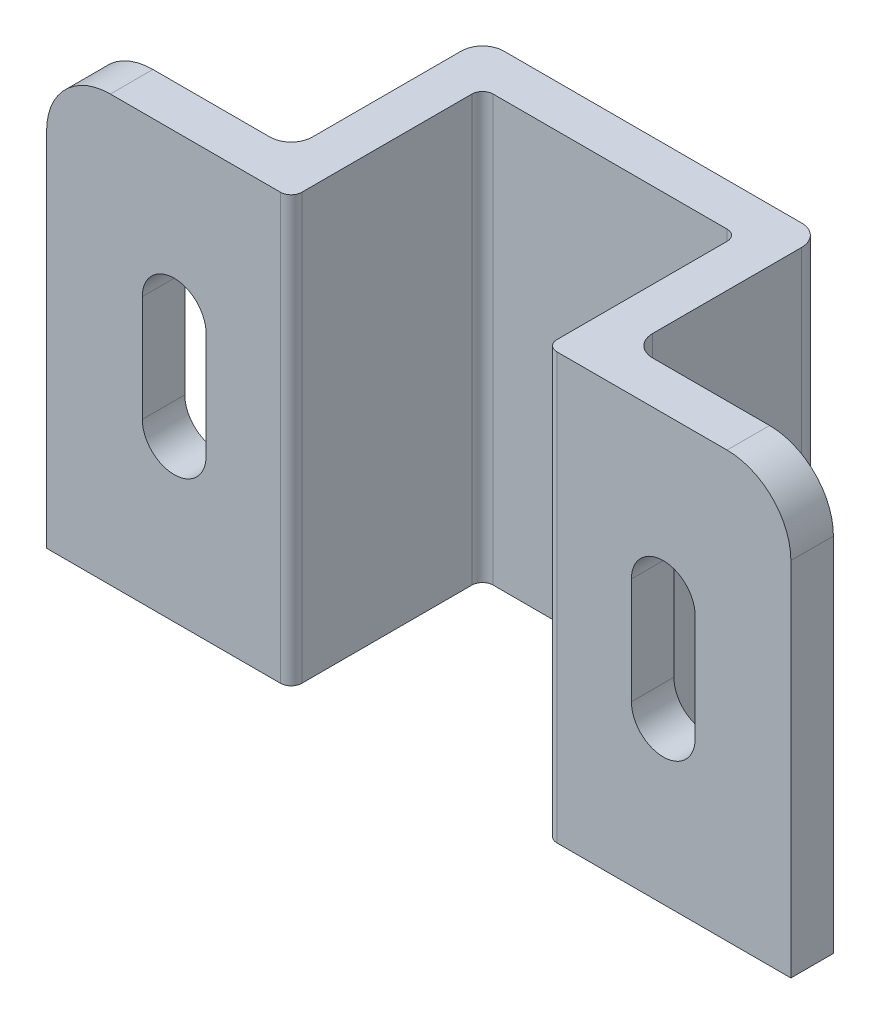
ISO-10303-21;
HEADER;
FILE_DESCRIPTION(('STEP AP214'),'2;1');
FILE_NAME('part.step','',(''),(''),'','','');
FILE_SCHEMA(('AUTOMOTIVE_DESIGN { 1 0 10303 214 1 1 1 1 }'));
ENDSEC;
DATA;
#1=APPLICATION_CONTEXT('core data for automotive mechanical design processes');
#2=APPLICATION_PROTOCOL_DEFINITION('international standard','automotive_design',2000,#1);
#3=PRODUCT_CONTEXT('',#1,'mechanical');
#4=PRODUCT('Part','Part','',(#3));
#5=PRODUCT_RELATED_PRODUCT_CATEGORY('part','',(#4));
#6=PRODUCT_DEFINITION_FORMATION('','',#4);
#7=PRODUCT_DEFINITION_CONTEXT('part definition',#1,'design');
#8=PRODUCT_DEFINITION('design','',#6,#7);
#9=PRODUCT_DEFINITION_SHAPE('','',#8);
#10=(LENGTH_UNIT() NAMED_UNIT(*) SI_UNIT(.MILLI.,.METRE.));
#11=(NAMED_UNIT(*) PLANE_ANGLE_UNIT() SI_UNIT($,.RADIAN.));
#12=(NAMED_UNIT(*) SI_UNIT($,.STERADIAN.) SOLID_ANGLE_UNIT());
#13=UNCERTAINTY_MEASURE_WITH_UNIT(LENGTH_MEASURE(1.E-05),#10,'distance_accuracy_value','');
#14=(GEOMETRIC_REPRESENTATION_CONTEXT(3) GLOBAL_UNCERTAINTY_ASSIGNED_CONTEXT((#13)) GLOBAL_UNIT_ASSIGNED_CONTEXT((#10,
#11,#12)) REPRESENTATION_CONTEXT('',''));
#15=CARTESIAN_POINT('',(0.,0.,0.));
#16=DIRECTION('',(0.,0.,1.));
#17=DIRECTION('',(1.,0.,0.));
#18=AXIS2_PLACEMENT_3D('',#15,#16,#17);
#19=CARTESIAN_POINT('',(0.,0.,2.));
#20=DIRECTION('',(0.,0.,-1.));
#21=DIRECTION('',(-1.,0.,0.));
#22=AXIS2_PLACEMENT_3D('',#19,#20,#21);
#23=PLANE('',#22);
#24=DIRECTION('',(-1.,0.,0.));
#25=VECTOR('',#24,1.);
#26=CARTESIAN_POINT('',(0.,20.,2.));
#27=LINE('',#26,#25);
#28=CARTESIAN_POINT('',(23.,20.,2.));
#29=VERTEX_POINT('',#28);
#30=CARTESIAN_POINT('',(12.,20.,2.));
#31=VERTEX_POINT('',#30);
#32=EDGE_CURVE('E341',#29,#31,#27,.T.);
#33=ORIENTED_EDGE('',*,*,#32,.T.);
#34=DIRECTION('',(0.,1.,0.));
#35=VECTOR('',#34,1.);
#36=CARTESIAN_POINT('',(12.,0.,2.));
#37=LINE('',#36,#35);
#38=CARTESIAN_POINT('',(12.,0.,2.));
#39=VERTEX_POINT('',#38);
#40=EDGE_CURVE('E399',#31,#39,#37,.F.);
#41=ORIENTED_EDGE('',*,*,#40,.T.);
#42=DIRECTION('',(1.,0.,0.));
#43=VECTOR('',#42,1.);
#44=CARTESIAN_POINT('',(0.,0.,2.));
#45=LINE('',#44,#43);
#46=CARTESIAN_POINT('',(23.,0.,2.));
#47=VERTEX_POINT('',#46);
#48=EDGE_CURVE('E338',#39,#47,#45,.T.);
#49=ORIENTED_EDGE('',*,*,#48,.T.);
#50=DIRECTION('',(0.,-1.,0.));
#51=VECTOR('',#50,1.);
#52=CARTESIAN_POINT('',(23.,20.,2.));
#53=LINE('',#52,#51);
#54=EDGE_CURVE('E397',#47,#29,#53,.F.);
#55=ORIENTED_EDGE('',*,*,#54,.T.);
#56=EDGE_LOOP('',(#33,#41,#49,#55));
#57=FACE_BOUND('',#56,.T.);
#58=ADVANCED_FACE('F33',(#57),#23,.F.);
#59=CARTESIAN_POINT('',(0.,0.,2.));
#60=DIRECTION('',(1.,0.,0.));
#61=DIRECTION('',(0.,0.,-1.));
#62=AXIS2_PLACEMENT_3D('',#59,#60,#61);
#63=PLANE('',#62);
#64=DIRECTION('',(0.,-1.,0.));
#65=VECTOR('',#64,1.);
#66=CARTESIAN_POINT('',(0.,20.,11.));
#67=LINE('',#66,#65);
#68=CARTESIAN_POINT('',(0.,17.,11.));
#69=VERTEX_POINT('',#68);
#70=CARTESIAN_POINT('',(0.,0.,11.));
#71=VERTEX_POINT('',#70);
#72=EDGE_CURVE('E323',#69,#71,#67,.T.);
#73=ORIENTED_EDGE('',*,*,#72,.F.);
#74=DIRECTION('',(0.,0.,-1.));
#75=VECTOR('',#74,1.);
#76=CARTESIAN_POINT('',(0.,17.,2.));
#77=LINE('',#76,#75);
#78=CARTESIAN_POINT('',(0.,17.,9.));
#79=VERTEX_POINT('',#78);
#80=EDGE_CURVE('E450',#69,#79,#77,.T.);
#81=ORIENTED_EDGE('',*,*,#80,.T.);
#82=DIRECTION('',(0.,1.,0.));
#83=VECTOR('',#82,1.);
#84=CARTESIAN_POINT('',(0.,0.,9.));
#85=LINE('',#84,#83);
#86=CARTESIAN_POINT('',(0.,0.,9.));
#87=VERTEX_POINT('',#86);
#88=EDGE_CURVE('E293',#87,#79,#85,.T.);
#89=ORIENTED_EDGE('',*,*,#88,.F.);
#90=DIRECTION('',(0.,0.,-1.));
#91=VECTOR('',#90,1.);
#92=CARTESIAN_POINT('',(0.,0.,2.));
#93=LINE('',#92,#91);
#94=EDGE_CURVE('E352',#71,#87,#93,.T.);
#95=ORIENTED_EDGE('',*,*,#94,.F.);
#96=EDGE_LOOP('',(#73,#81,#89,#95));
#97=FACE_BOUND('',#96,.T.);
#98=ADVANCED_FACE('F470',(#97),#63,.F.);
#99=CARTESIAN_POINT('',(0.,0.,2.));
#100=DIRECTION('',(0.,1.,0.));
#101=DIRECTION('',(0.,0.,1.));
#102=AXIS2_PLACEMENT_3D('',#99,#100,#101);
#103=PLANE('',#102);
#104=DIRECTION('',(1.,0.,0.));
#105=VECTOR('',#104,1.);
#106=CARTESIAN_POINT('',(35.,0.,11.));
#107=LINE('',#106,#105);
#108=CARTESIAN_POINT('',(24.,0.,11.));
#109=VERTEX_POINT('',#108);
#110=CARTESIAN_POINT('',(35.,0.,11.));
#111=VERTEX_POINT('',#110);
#112=EDGE_CURVE('E315',#109,#111,#107,.T.);
#113=ORIENTED_EDGE('',*,*,#112,.F.);
#114=CARTESIAN_POINT('',(24.,0.,10.5));
#115=DIRECTION('',(0.,1.,0.));
#116=DIRECTION('',(0.,0.,1.));
#117=AXIS2_PLACEMENT_3D('',#114,#115,#116);
#118=CIRCLE('',#117,0.5);
#119=CARTESIAN_POINT('',(23.5,0.,10.5));
#120=VERTEX_POINT('',#119);
#121=EDGE_CURVE('E411',#109,#120,#118,.F.);
#122=ORIENTED_EDGE('',*,*,#121,.T.);
#123=DIRECTION('',(0.,0.,-1.));
#124=VECTOR('',#123,1.);
#125=CARTESIAN_POINT('',(23.5,0.,11.));
#126=LINE('',#125,#124);
#127=CARTESIAN_POINT('',(23.5,0.,2.5));
#128=VERTEX_POINT('',#127);
#129=EDGE_CURVE('E317',#120,#128,#126,.T.);
#130=ORIENTED_EDGE('',*,*,#129,.T.);
#131=CARTESIAN_POINT('',(23.,0.,2.5));
#132=DIRECTION('',(0.,1.,0.));
#133=DIRECTION('',(0.,0.,1.));
#134=AXIS2_PLACEMENT_3D('',#131,#132,#133);
#135=CIRCLE('',#134,0.5);
#136=EDGE_CURVE('E425',#128,#47,#135,.T.);
#137=ORIENTED_EDGE('',*,*,#136,.T.);
#138=ORIENTED_EDGE('',*,*,#48,.F.);
#139=CARTESIAN_POINT('',(12.,0.,2.5));
#140=DIRECTION('',(0.,1.,0.));
#141=DIRECTION('',(0.,0.,1.));
#142=AXIS2_PLACEMENT_3D('',#139,#140,#141);
#143=CIRCLE('',#142,0.5);
#144=CARTESIAN_POINT('',(11.5,0.,2.5));
#145=VERTEX_POINT('',#144);
#146=EDGE_CURVE('E423',#39,#145,#143,.T.);
#147=ORIENTED_EDGE('',*,*,#146,.T.);
#148=DIRECTION('',(0.,0.,-1.));
#149=VECTOR('',#148,1.);
#150=CARTESIAN_POINT('',(11.5,0.,11.));
#151=LINE('',#150,#149);
#152=CARTESIAN_POINT('',(11.5,0.,10.5));
#153=VERTEX_POINT('',#152);
#154=EDGE_CURVE('E334',#153,#145,#151,.T.);
#155=ORIENTED_EDGE('',*,*,#154,.F.);
#156=CARTESIAN_POINT('',(11.,0.,10.5));
#157=DIRECTION('',(0.,1.,0.));
#158=DIRECTION('',(0.,0.,1.));
#159=AXIS2_PLACEMENT_3D('',#156,#157,#158);
#160=CIRCLE('',#159,0.5);
#161=CARTESIAN_POINT('',(11.,0.,11.));
#162=VERTEX_POINT('',#161);
#163=EDGE_CURVE('E409',#153,#162,#160,.F.);
#164=ORIENTED_EDGE('',*,*,#163,.T.);
#165=DIRECTION('',(1.,0.,0.));
#166=VECTOR('',#165,1.);
#167=CARTESIAN_POINT('',(0.,0.,11.));
#168=LINE('',#167,#166);
#169=EDGE_CURVE('E325',#71,#162,#168,.T.);
#170=ORIENTED_EDGE('',*,*,#169,.F.);
#171=ORIENTED_EDGE('',*,*,#94,.T.);
#172=DIRECTION('',(1.,0.,0.));
#173=VECTOR('',#172,1.);
#174=CARTESIAN_POINT('',(0.,0.,9.));
#175=LINE('',#174,#173);
#176=CARTESIAN_POINT('',(8.5,0.,9.));
#177=VERTEX_POINT('',#176);
#178=EDGE_CURVE('E286',#87,#177,#175,.T.);
#179=ORIENTED_EDGE('',*,*,#178,.T.);
#180=CARTESIAN_POINT('',(8.5,0.,8.));
#181=DIRECTION('',(0.,1.,0.));
#182=DIRECTION('',(0.,0.,1.));
#183=AXIS2_PLACEMENT_3D('',#180,#181,#182);
#184=CIRCLE('',#183,1.);
#185=CARTESIAN_POINT('',(9.5,0.,8.));
#186=VERTEX_POINT('',#185);
#187=EDGE_CURVE('E390',#177,#186,#184,.T.);
#188=ORIENTED_EDGE('',*,*,#187,.T.);
#189=DIRECTION('',(0.,0.,-1.));
#190=VECTOR('',#189,1.);
#191=CARTESIAN_POINT('',(9.5,0.,0.));
#192=LINE('',#191,#190);
#193=CARTESIAN_POINT('',(9.5,0.,1.));
#194=VERTEX_POINT('',#193);
#195=EDGE_CURVE('E289',#186,#194,#192,.T.);
#196=ORIENTED_EDGE('',*,*,#195,.T.);
#197=CARTESIAN_POINT('',(10.5,0.,1.));
#198=DIRECTION('',(0.,1.,0.));
#199=DIRECTION('',(0.,0.,1.));
#200=AXIS2_PLACEMENT_3D('',#197,#198,#199);
#201=CIRCLE('',#200,1.);
#202=CARTESIAN_POINT('',(10.5,0.,0.));
#203=VERTEX_POINT('',#202);
#204=EDGE_CURVE('E379',#194,#203,#201,.F.);
#205=ORIENTED_EDGE('',*,*,#204,.T.);
#206=DIRECTION('',(1.,0.,0.));
#207=VECTOR('',#206,1.);
#208=CARTESIAN_POINT('',(0.,0.,0.));
#209=LINE('',#208,#207);
#210=CARTESIAN_POINT('',(24.5,0.,0.));
#211=VERTEX_POINT('',#210);
#212=EDGE_CURVE('E337',#203,#211,#209,.T.);
#213=ORIENTED_EDGE('',*,*,#212,.T.);
#214=CARTESIAN_POINT('',(24.5,0.,1.));
#215=DIRECTION('',(0.,1.,0.));
#216=DIRECTION('',(0.,0.,1.));
#217=AXIS2_PLACEMENT_3D('',#214,#215,#216);
#218=CIRCLE('',#217,1.);
#219=CARTESIAN_POINT('',(25.5,0.,1.));
#220=VERTEX_POINT('',#219);
#221=EDGE_CURVE('E381',#211,#220,#218,.F.);
#222=ORIENTED_EDGE('',*,*,#221,.T.);
#223=DIRECTION('',(0.,0.,1.));
#224=VECTOR('',#223,1.);
#225=CARTESIAN_POINT('',(25.5,0.,0.));
#226=LINE('',#225,#224);
#227=CARTESIAN_POINT('',(25.5,0.,8.));
#228=VERTEX_POINT('',#227);
#229=EDGE_CURVE('E302',#220,#228,#226,.T.);
#230=ORIENTED_EDGE('',*,*,#229,.T.);
#231=CARTESIAN_POINT('',(26.5,0.,8.));
#232=DIRECTION('',(0.,1.,0.));
#233=DIRECTION('',(0.,0.,1.));
#234=AXIS2_PLACEMENT_3D('',#231,#232,#233);
#235=CIRCLE('',#234,1.);
#236=CARTESIAN_POINT('',(26.5,0.,9.));
#237=VERTEX_POINT('',#236);
#238=EDGE_CURVE('E385',#228,#237,#235,.T.);
#239=ORIENTED_EDGE('',*,*,#238,.T.);
#240=DIRECTION('',(1.,0.,0.));
#241=VECTOR('',#240,1.);
#242=CARTESIAN_POINT('',(35.,0.,9.));
#243=LINE('',#242,#241);
#244=CARTESIAN_POINT('',(35.,0.,9.));
#245=VERTEX_POINT('',#244);
#246=EDGE_CURVE('E305',#237,#245,#243,.T.);
#247=ORIENTED_EDGE('',*,*,#246,.T.);
#248=DIRECTION('',(0.,0.,-1.));
#249=VECTOR('',#248,1.);
#250=CARTESIAN_POINT('',(35.,0.,2.));
#251=LINE('',#250,#249);
#252=EDGE_CURVE('E345',#111,#245,#251,.T.);
#253=ORIENTED_EDGE('',*,*,#252,.F.);
#254=EDGE_LOOP('',(#113,#122,#130,#137,#138,#147,#155,#164,#170,#171,#179,#188,#196,#205,#213,
#222,#230,#239,#247,#253));
#255=FACE_BOUND('',#254,.T.);
#256=ADVANCED_FACE('F487',(#255),#103,.F.);
#257=CARTESIAN_POINT('',(35.,0.,2.));
#258=DIRECTION('',(-1.,0.,0.));
#259=DIRECTION('',(0.,0.,1.));
#260=AXIS2_PLACEMENT_3D('',#257,#258,#259);
#261=PLANE('',#260);
#262=DIRECTION('',(0.,1.,0.));
#263=VECTOR('',#262,1.);
#264=CARTESIAN_POINT('',(35.,0.,9.));
#265=LINE('',#264,#263);
#266=CARTESIAN_POINT('',(35.,17.,9.));
#267=VERTEX_POINT('',#266);
#268=EDGE_CURVE('E296',#245,#267,#265,.T.);
#269=ORIENTED_EDGE('',*,*,#268,.T.);
#270=DIRECTION('',(0.,0.,-1.));
#271=VECTOR('',#270,1.);
#272=CARTESIAN_POINT('',(35.,17.,2.));
#273=LINE('',#272,#271);
#274=CARTESIAN_POINT('',(35.,17.,11.));
#275=VERTEX_POINT('',#274);
#276=EDGE_CURVE('E41',#267,#275,#273,.F.);
#277=ORIENTED_EDGE('',*,*,#276,.T.);
#278=DIRECTION('',(0.,1.,0.));
#279=VECTOR('',#278,1.);
#280=CARTESIAN_POINT('',(35.,20.,11.));
#281=LINE('',#280,#279);
#282=EDGE_CURVE('E301',#111,#275,#281,.T.);
#283=ORIENTED_EDGE('',*,*,#282,.F.);
#284=ORIENTED_EDGE('',*,*,#252,.T.);
#285=EDGE_LOOP('',(#269,#277,#283,#284));
#286=FACE_BOUND('',#285,.T.);
#287=ADVANCED_FACE('F528',(#286),#261,.F.);
#288=CARTESIAN_POINT('',(0.,20.,2.));
#289=DIRECTION('',(0.,-1.,0.));
#290=DIRECTION('',(0.,0.,-1.));
#291=AXIS2_PLACEMENT_3D('',#288,#289,#290);
#292=PLANE('',#291);
#293=DIRECTION('',(1.,0.,0.));
#294=VECTOR('',#293,1.);
#295=CARTESIAN_POINT('',(0.,20.,9.));
#296=LINE('',#295,#294);
#297=CARTESIAN_POINT('',(3.,20.,9.));
#298=VERTEX_POINT('',#297);
#299=CARTESIAN_POINT('',(8.5,20.,9.));
#300=VERTEX_POINT('',#299);
#301=EDGE_CURVE('E294',#298,#300,#296,.T.);
#302=ORIENTED_EDGE('',*,*,#301,.F.);
#303=DIRECTION('',(0.,0.,-1.));
#304=VECTOR('',#303,1.);
#305=CARTESIAN_POINT('',(3.,20.,2.));
#306=LINE('',#305,#304);
#307=CARTESIAN_POINT('',(3.,20.,11.));
#308=VERTEX_POINT('',#307);
#309=EDGE_CURVE('E458',#298,#308,#306,.F.);
#310=ORIENTED_EDGE('',*,*,#309,.T.);
#311=DIRECTION('',(-1.,0.,0.));
#312=VECTOR('',#311,1.);
#313=CARTESIAN_POINT('',(0.,20.,11.));
#314=LINE('',#313,#312);
#315=CARTESIAN_POINT('',(11.,20.,11.));
#316=VERTEX_POINT('',#315);
#317=EDGE_CURVE('E328',#316,#308,#314,.T.);
#318=ORIENTED_EDGE('',*,*,#317,.F.);
#319=CARTESIAN_POINT('',(11.,20.,10.5));
#320=DIRECTION('',(0.,-1.,0.));
#321=DIRECTION('',(0.,0.,-1.));
#322=AXIS2_PLACEMENT_3D('',#319,#320,#321);
#323=CIRCLE('',#322,0.5);
#324=CARTESIAN_POINT('',(11.5,20.,10.5));
#325=VERTEX_POINT('',#324);
#326=EDGE_CURVE('E413',#316,#325,#323,.F.);
#327=ORIENTED_EDGE('',*,*,#326,.T.);
#328=DIRECTION('',(0.,0.,-1.));
#329=VECTOR('',#328,1.);
#330=CARTESIAN_POINT('',(11.5,20.,11.));
#331=LINE('',#330,#329);
#332=CARTESIAN_POINT('',(11.5,20.,2.5));
#333=VERTEX_POINT('',#332);
#334=EDGE_CURVE('E331',#325,#333,#331,.T.);
#335=ORIENTED_EDGE('',*,*,#334,.T.);
#336=CARTESIAN_POINT('',(12.,20.,2.5));
#337=DIRECTION('',(0.,-1.,0.));
#338=DIRECTION('',(0.,0.,-1.));
#339=AXIS2_PLACEMENT_3D('',#336,#337,#338);
#340=CIRCLE('',#339,0.5);
#341=EDGE_CURVE('E421',#333,#31,#340,.T.);
#342=ORIENTED_EDGE('',*,*,#341,.T.);
#343=ORIENTED_EDGE('',*,*,#32,.F.);
#344=CARTESIAN_POINT('',(23.,20.,2.5));
#345=DIRECTION('',(0.,-1.,0.));
#346=DIRECTION('',(0.,0.,-1.));
#347=AXIS2_PLACEMENT_3D('',#344,#345,#346);
#348=CIRCLE('',#347,0.5);
#349=CARTESIAN_POINT('',(23.5,20.,2.5));
#350=VERTEX_POINT('',#349);
#351=EDGE_CURVE('E427',#29,#350,#348,.T.);
#352=ORIENTED_EDGE('',*,*,#351,.T.);
#353=DIRECTION('',(0.,0.,-1.));
#354=VECTOR('',#353,1.);
#355=CARTESIAN_POINT('',(23.5,20.,11.));
#356=LINE('',#355,#354);
#357=CARTESIAN_POINT('',(23.5,20.,10.5));
#358=VERTEX_POINT('',#357);
#359=EDGE_CURVE('E320',#358,#350,#356,.T.);
#360=ORIENTED_EDGE('',*,*,#359,.F.);
#361=CARTESIAN_POINT('',(24.,20.,10.5));
#362=DIRECTION('',(0.,-1.,0.));
#363=DIRECTION('',(0.,0.,-1.));
#364=AXIS2_PLACEMENT_3D('',#361,#362,#363);
#365=CIRCLE('',#364,0.5);
#366=CARTESIAN_POINT('',(24.,20.,11.));
#367=VERTEX_POINT('',#366);
#368=EDGE_CURVE('E415',#358,#367,#365,.F.);
#369=ORIENTED_EDGE('',*,*,#368,.T.);
#370=DIRECTION('',(-1.,0.,0.));
#371=VECTOR('',#370,1.);
#372=CARTESIAN_POINT('',(35.,20.,11.));
#373=LINE('',#372,#371);
#374=CARTESIAN_POINT('',(32.,20.,11.));
#375=VERTEX_POINT('',#374);
#376=EDGE_CURVE('E313',#375,#367,#373,.T.);
#377=ORIENTED_EDGE('',*,*,#376,.F.);
#378=DIRECTION('',(0.,0.,-1.));
#379=VECTOR('',#378,1.);
#380=CARTESIAN_POINT('',(32.,20.,2.));
#381=LINE('',#380,#379);
#382=CARTESIAN_POINT('',(32.,20.,9.));
#383=VERTEX_POINT('',#382);
#384=EDGE_CURVE('E455',#375,#383,#381,.T.);
#385=ORIENTED_EDGE('',*,*,#384,.T.);
#386=DIRECTION('',(1.,0.,0.));
#387=VECTOR('',#386,1.);
#388=CARTESIAN_POINT('',(35.,20.,9.));
#389=LINE('',#388,#387);
#390=CARTESIAN_POINT('',(26.5,20.,9.));
#391=VERTEX_POINT('',#390);
#392=EDGE_CURVE('E306',#391,#383,#389,.T.);
#393=ORIENTED_EDGE('',*,*,#392,.F.);
#394=CARTESIAN_POINT('',(26.5,20.,8.));
#395=DIRECTION('',(0.,-1.,0.));
#396=DIRECTION('',(0.,0.,-1.));
#397=AXIS2_PLACEMENT_3D('',#394,#395,#396);
#398=CIRCLE('',#397,1.);
#399=CARTESIAN_POINT('',(25.5,20.,8.));
#400=VERTEX_POINT('',#399);
#401=EDGE_CURVE('E383',#391,#400,#398,.T.);
#402=ORIENTED_EDGE('',*,*,#401,.T.);
#403=DIRECTION('',(0.,0.,1.));
#404=VECTOR('',#403,1.);
#405=CARTESIAN_POINT('',(25.5,20.,0.));
#406=LINE('',#405,#404);
#407=CARTESIAN_POINT('',(25.5,20.,1.));
#408=VERTEX_POINT('',#407);
#409=EDGE_CURVE('E263',#408,#400,#406,.T.);
#410=ORIENTED_EDGE('',*,*,#409,.F.);
#411=CARTESIAN_POINT('',(24.5,20.,1.));
#412=DIRECTION('',(0.,-1.,0.));
#413=DIRECTION('',(0.,0.,-1.));
#414=AXIS2_PLACEMENT_3D('',#411,#412,#413);
#415=CIRCLE('',#414,1.);
#416=CARTESIAN_POINT('',(24.5,20.,0.));
#417=VERTEX_POINT('',#416);
#418=EDGE_CURVE('E372',#408,#417,#415,.F.);
#419=ORIENTED_EDGE('',*,*,#418,.T.);
#420=DIRECTION('',(-1.,0.,0.));
#421=VECTOR('',#420,1.);
#422=CARTESIAN_POINT('',(0.,20.,0.));
#423=LINE('',#422,#421);
#424=CARTESIAN_POINT('',(10.5,20.,0.));
#425=VERTEX_POINT('',#424);
#426=EDGE_CURVE('E342',#417,#425,#423,.T.);
#427=ORIENTED_EDGE('',*,*,#426,.T.);
#428=CARTESIAN_POINT('',(10.5,20.,1.));
#429=DIRECTION('',(0.,-1.,0.));
#430=DIRECTION('',(0.,0.,-1.));
#431=AXIS2_PLACEMENT_3D('',#428,#429,#430);
#432=CIRCLE('',#431,1.);
#433=CARTESIAN_POINT('',(9.5,20.,1.));
#434=VERTEX_POINT('',#433);
#435=EDGE_CURVE('E370',#425,#434,#432,.F.);
#436=ORIENTED_EDGE('',*,*,#435,.T.);
#437=DIRECTION('',(0.,0.,-1.));
#438=VECTOR('',#437,1.);
#439=CARTESIAN_POINT('',(9.5,20.,0.));
#440=LINE('',#439,#438);
#441=CARTESIAN_POINT('',(9.5,20.,8.));
#442=VERTEX_POINT('',#441);
#443=EDGE_CURVE('E290',#442,#434,#440,.T.);
#444=ORIENTED_EDGE('',*,*,#443,.F.);
#445=CARTESIAN_POINT('',(8.5,20.,8.));
#446=DIRECTION('',(0.,-1.,0.));
#447=DIRECTION('',(0.,0.,-1.));
#448=AXIS2_PLACEMENT_3D('',#445,#446,#447);
#449=CIRCLE('',#448,1.);
#450=EDGE_CURVE('E387',#442,#300,#449,.T.);
#451=ORIENTED_EDGE('',*,*,#450,.T.);
#452=EDGE_LOOP('',(#302,#310,#318,#327,#335,#342,#343,#352,#360,#369,#377,#385,#393,#402,#410,
#419,#427,#436,#444,#451));
#453=FACE_BOUND('',#452,.T.);
#454=ADVANCED_FACE('F478',(#453),#292,.F.);
#455=CARTESIAN_POINT('',(0.,0.,0.));
#456=DIRECTION('',(0.,0.,-1.));
#457=DIRECTION('',(-1.,0.,0.));
#458=AXIS2_PLACEMENT_3D('',#455,#456,#457);
#459=PLANE('',#458);
#460=ORIENTED_EDGE('',*,*,#426,.F.);
#461=DIRECTION('',(0.,1.,0.));
#462=VECTOR('',#461,1.);
#463=CARTESIAN_POINT('',(24.5,0.,0.));
#464=LINE('',#463,#462);
#465=EDGE_CURVE('E377',#417,#211,#464,.F.);
#466=ORIENTED_EDGE('',*,*,#465,.T.);
#467=ORIENTED_EDGE('',*,*,#212,.F.);
#468=DIRECTION('',(0.,1.,0.));
#469=VECTOR('',#468,1.);
#470=CARTESIAN_POINT('',(10.5,20.,0.));
#471=LINE('',#470,#469);
#472=EDGE_CURVE('E374',#203,#425,#471,.T.);
#473=ORIENTED_EDGE('',*,*,#472,.T.);
#474=EDGE_LOOP('',(#460,#466,#467,#473));
#475=FACE_BOUND('',#474,.T.);
#476=ADVANCED_FACE('F556',(#475),#459,.T.);
#477=CARTESIAN_POINT('',(11.5,20.,11.));
#478=DIRECTION('',(-1.,0.,0.));
#479=DIRECTION('',(0.,0.,1.));
#480=AXIS2_PLACEMENT_3D('',#477,#478,#479);
#481=PLANE('',#480);
#482=ORIENTED_EDGE('',*,*,#154,.T.);
#483=DIRECTION('',(0.,1.,0.));
#484=VECTOR('',#483,1.);
#485=CARTESIAN_POINT('',(11.5,20.,2.5));
#486=LINE('',#485,#484);
#487=EDGE_CURVE('E394',#145,#333,#486,.T.);
#488=ORIENTED_EDGE('',*,*,#487,.T.);
#489=ORIENTED_EDGE('',*,*,#334,.F.);
#490=DIRECTION('',(0.,1.,0.));
#491=VECTOR('',#490,1.);
#492=CARTESIAN_POINT('',(11.5,0.,10.5));
#493=LINE('',#492,#491);
#494=EDGE_CURVE('E392',#325,#153,#493,.F.);
#495=ORIENTED_EDGE('',*,*,#494,.T.);
#496=EDGE_LOOP('',(#482,#488,#489,#495));
#497=FACE_BOUND('',#496,.T.);
#498=ADVANCED_FACE('F497',(#497),#481,.F.);
#499=CARTESIAN_POINT('',(0.,0.,11.));
#500=DIRECTION('',(0.,0.,1.));
#501=DIRECTION('',(1.,0.,0.));
#502=AXIS2_PLACEMENT_3D('',#499,#500,#501);
#503=PLANE('',#502);
#504=CARTESIAN_POINT('',(6.,12.5,11.));
#505=DIRECTION('',(0.,0.,1.));
#506=DIRECTION('',(1.,0.,0.));
#507=AXIS2_PLACEMENT_3D('',#504,#505,#506);
#508=CIRCLE('',#507,1.5);
#509=CARTESIAN_POINT('',(7.5,12.5,11.));
#510=VERTEX_POINT('',#509);
#511=CARTESIAN_POINT('',(4.5,12.5,11.));
#512=VERTEX_POINT('',#511);
#513=EDGE_CURVE('E251',#510,#512,#508,.T.);
#514=ORIENTED_EDGE('',*,*,#513,.F.);
#515=DIRECTION('',(0.,1.,0.));
#516=VECTOR('',#515,1.);
#517=CARTESIAN_POINT('',(7.5,12.5,11.));
#518=LINE('',#517,#516);
#519=CARTESIAN_POINT('',(7.5,7.5,11.));
#520=VERTEX_POINT('',#519);
#521=EDGE_CURVE('E256',#520,#510,#518,.T.);
#522=ORIENTED_EDGE('',*,*,#521,.F.);
#523=CARTESIAN_POINT('',(6.,7.5,11.));
#524=DIRECTION('',(0.,0.,1.));
#525=DIRECTION('',(1.,0.,0.));
#526=AXIS2_PLACEMENT_3D('',#523,#524,#525);
#527=CIRCLE('',#526,1.5);
#528=CARTESIAN_POINT('',(4.5,7.5,11.));
#529=VERTEX_POINT('',#528);
#530=EDGE_CURVE('E235',#529,#520,#527,.T.);
#531=ORIENTED_EDGE('',*,*,#530,.F.);
#532=DIRECTION('',(0.,-1.,0.));
#533=VECTOR('',#532,1.);
#534=CARTESIAN_POINT('',(4.5,12.5,11.));
#535=LINE('',#534,#533);
#536=EDGE_CURVE('E246',#512,#529,#535,.T.);
#537=ORIENTED_EDGE('',*,*,#536,.F.);
#538=EDGE_LOOP('',(#514,#522,#531,#537));
#539=FACE_BOUND('',#538,.T.);
#540=ORIENTED_EDGE('',*,*,#317,.T.);
#541=CARTESIAN_POINT('',(3.,17.,11.));
#542=DIRECTION('',(0.,0.,1.));
#543=DIRECTION('',(1.,0.,0.));
#544=AXIS2_PLACEMENT_3D('',#541,#542,#543);
#545=CIRCLE('',#544,3.);
#546=EDGE_CURVE('E460',#308,#69,#545,.T.);
#547=ORIENTED_EDGE('',*,*,#546,.T.);
#548=ORIENTED_EDGE('',*,*,#72,.T.);
#549=ORIENTED_EDGE('',*,*,#169,.T.);
#550=DIRECTION('',(0.,1.,0.));
#551=VECTOR('',#550,1.);
#552=CARTESIAN_POINT('',(11.,20.,11.));
#553=LINE('',#552,#551);
#554=EDGE_CURVE('E418',#162,#316,#553,.T.);
#555=ORIENTED_EDGE('',*,*,#554,.T.);
#556=EDGE_LOOP('',(#540,#547,#548,#549,#555));
#557=FACE_BOUND('',#556,.T.);
#558=ADVANCED_FACE('F253',(#539,#557),#503,.T.);
#559=CARTESIAN_POINT('',(23.5,20.,11.));
#560=DIRECTION('',(1.,0.,0.));
#561=DIRECTION('',(0.,0.,-1.));
#562=AXIS2_PLACEMENT_3D('',#559,#560,#561);
#563=PLANE('',#562);
#564=ORIENTED_EDGE('',*,*,#359,.T.);
#565=DIRECTION('',(0.,-1.,0.));
#566=VECTOR('',#565,1.);
#567=CARTESIAN_POINT('',(23.5,0.,2.5));
#568=LINE('',#567,#566);
#569=EDGE_CURVE('E403',#350,#128,#568,.T.);
#570=ORIENTED_EDGE('',*,*,#569,.T.);
#571=ORIENTED_EDGE('',*,*,#129,.F.);
#572=DIRECTION('',(0.,-1.,0.));
#573=VECTOR('',#572,1.);
#574=CARTESIAN_POINT('',(23.5,20.,10.5));
#575=LINE('',#574,#573);
#576=EDGE_CURVE('E401',#120,#358,#575,.F.);
#577=ORIENTED_EDGE('',*,*,#576,.T.);
#578=EDGE_LOOP('',(#564,#570,#571,#577));
#579=FACE_BOUND('',#578,.T.);
#580=ADVANCED_FACE('F514',(#579),#563,.F.);
#581=CARTESIAN_POINT('',(0.,0.,11.));
#582=DIRECTION('',(0.,0.,-1.));
#583=DIRECTION('',(-1.,0.,0.));
#584=AXIS2_PLACEMENT_3D('',#581,#582,#583);
#585=PLANE('',#584);
#586=DIRECTION('',(0.,-1.,0.));
#587=VECTOR('',#586,1.);
#588=CARTESIAN_POINT('',(27.5,12.5,11.));
#589=LINE('',#588,#587);
#590=CARTESIAN_POINT('',(27.5,12.5,11.));
#591=VERTEX_POINT('',#590);
#592=CARTESIAN_POINT('',(27.5,7.5,11.));
#593=VERTEX_POINT('',#592);
#594=EDGE_CURVE('E268',#591,#593,#589,.T.);
#595=ORIENTED_EDGE('',*,*,#594,.F.);
#596=CARTESIAN_POINT('',(29.,12.5,11.));
#597=DIRECTION('',(0.,0.,1.));
#598=DIRECTION('',(1.,0.,0.));
#599=AXIS2_PLACEMENT_3D('',#596,#597,#598);
#600=CIRCLE('',#599,1.5);
#601=CARTESIAN_POINT('',(30.5,12.5,11.));
#602=VERTEX_POINT('',#601);
#603=EDGE_CURVE('E266',#602,#591,#600,.T.);
#604=ORIENTED_EDGE('',*,*,#603,.F.);
#605=DIRECTION('',(0.,1.,0.));
#606=VECTOR('',#605,1.);
#607=CARTESIAN_POINT('',(30.5,12.5,11.));
#608=LINE('',#607,#606);
#609=CARTESIAN_POINT('',(30.5,7.5,11.));
#610=VERTEX_POINT('',#609);
#611=EDGE_CURVE('E274',#610,#602,#608,.T.);
#612=ORIENTED_EDGE('',*,*,#611,.F.);
#613=CARTESIAN_POINT('',(29.,7.5,11.));
#614=DIRECTION('',(0.,0.,1.));
#615=DIRECTION('',(1.,0.,0.));
#616=AXIS2_PLACEMENT_3D('',#613,#614,#615);
#617=CIRCLE('',#616,1.5);
#618=EDGE_CURVE('E271',#593,#610,#617,.T.);
#619=ORIENTED_EDGE('',*,*,#618,.F.);
#620=EDGE_LOOP('',(#595,#604,#612,#619));
#621=FACE_BOUND('',#620,.T.);
#622=ORIENTED_EDGE('',*,*,#282,.T.);
#623=CARTESIAN_POINT('',(32.,17.,11.));
#624=DIRECTION('',(0.,0.,-1.));
#625=DIRECTION('',(-1.,0.,0.));
#626=AXIS2_PLACEMENT_3D('',#623,#624,#625);
#627=CIRCLE('',#626,3.);
#628=EDGE_CURVE('E11',#275,#375,#627,.F.);
#629=ORIENTED_EDGE('',*,*,#628,.T.);
#630=ORIENTED_EDGE('',*,*,#376,.T.);
#631=DIRECTION('',(0.,-1.,0.));
#632=VECTOR('',#631,1.);
#633=CARTESIAN_POINT('',(24.,0.,11.));
#634=LINE('',#633,#632);
#635=EDGE_CURVE('E406',#367,#109,#634,.T.);
#636=ORIENTED_EDGE('',*,*,#635,.T.);
#637=ORIENTED_EDGE('',*,*,#112,.T.);
#638=EDGE_LOOP('',(#622,#629,#630,#636,#637));
#639=FACE_BOUND('',#638,.T.);
#640=ADVANCED_FACE('F526',(#621,#639),#585,.F.);
#641=CARTESIAN_POINT('',(35.,0.,9.));
#642=DIRECTION('',(0.,0.,1.));
#643=DIRECTION('',(1.,0.,0.));
#644=AXIS2_PLACEMENT_3D('',#641,#642,#643);
#645=PLANE('',#644);
#646=DIRECTION('',(0.,1.,0.));
#647=VECTOR('',#646,1.);
#648=CARTESIAN_POINT('',(30.5,0.,9.));
#649=LINE('',#648,#647);
#650=CARTESIAN_POINT('',(30.5,7.5,9.));
#651=VERTEX_POINT('',#650);
#652=CARTESIAN_POINT('',(30.5,12.5,9.));
#653=VERTEX_POINT('',#652);
#654=EDGE_CURVE('E444',#651,#653,#649,.T.);
#655=ORIENTED_EDGE('',*,*,#654,.T.);
#656=CARTESIAN_POINT('',(29.,12.5,9.));
#657=DIRECTION('',(0.,0.,1.));
#658=DIRECTION('',(1.,0.,0.));
#659=AXIS2_PLACEMENT_3D('',#656,#657,#658);
#660=CIRCLE('',#659,1.5);
#661=CARTESIAN_POINT('',(27.5,12.5,9.));
#662=VERTEX_POINT('',#661);
#663=EDGE_CURVE('E447',#653,#662,#660,.T.);
#664=ORIENTED_EDGE('',*,*,#663,.T.);
#665=DIRECTION('',(0.,-1.,0.));
#666=VECTOR('',#665,1.);
#667=CARTESIAN_POINT('',(27.5,0.,9.));
#668=LINE('',#667,#666);
#669=CARTESIAN_POINT('',(27.5,7.5,9.));
#670=VERTEX_POINT('',#669);
#671=EDGE_CURVE('E438',#662,#670,#668,.T.);
#672=ORIENTED_EDGE('',*,*,#671,.T.);
#673=CARTESIAN_POINT('',(29.,7.5,9.));
#674=DIRECTION('',(0.,0.,1.));
#675=DIRECTION('',(1.,0.,0.));
#676=AXIS2_PLACEMENT_3D('',#673,#674,#675);
#677=CIRCLE('',#676,1.5);
#678=EDGE_CURVE('E441',#670,#651,#677,.T.);
#679=ORIENTED_EDGE('',*,*,#678,.T.);
#680=EDGE_LOOP('',(#655,#664,#672,#679));
#681=FACE_BOUND('',#680,.T.);
#682=ORIENTED_EDGE('',*,*,#392,.T.);
#683=CARTESIAN_POINT('',(32.,17.,9.));
#684=DIRECTION('',(0.,0.,1.));
#685=DIRECTION('',(1.,0.,0.));
#686=AXIS2_PLACEMENT_3D('',#683,#684,#685);
#687=CIRCLE('',#686,3.);
#688=EDGE_CURVE('E55',#383,#267,#687,.F.);
#689=ORIENTED_EDGE('',*,*,#688,.T.);
#690=ORIENTED_EDGE('',*,*,#268,.F.);
#691=ORIENTED_EDGE('',*,*,#246,.F.);
#692=DIRECTION('',(0.,1.,0.));
#693=VECTOR('',#692,1.);
#694=CARTESIAN_POINT('',(26.5,20.,9.));
#695=LINE('',#694,#693);
#696=EDGE_CURVE('E355',#237,#391,#695,.T.);
#697=ORIENTED_EDGE('',*,*,#696,.T.);
#698=EDGE_LOOP('',(#682,#689,#690,#691,#697));
#699=FACE_BOUND('',#698,.T.);
#700=ADVANCED_FACE('F532',(#681,#699),#645,.F.);
#701=CARTESIAN_POINT('',(25.5,0.,0.));
#702=DIRECTION('',(-1.,0.,0.));
#703=DIRECTION('',(0.,0.,1.));
#704=AXIS2_PLACEMENT_3D('',#701,#702,#703);
#705=PLANE('',#704);
#706=ORIENTED_EDGE('',*,*,#409,.T.);
#707=DIRECTION('',(0.,1.,0.));
#708=VECTOR('',#707,1.);
#709=CARTESIAN_POINT('',(25.5,0.,8.));
#710=LINE('',#709,#708);
#711=EDGE_CURVE('E361',#400,#228,#710,.F.);
#712=ORIENTED_EDGE('',*,*,#711,.T.);
#713=ORIENTED_EDGE('',*,*,#229,.F.);
#714=DIRECTION('',(0.,1.,0.));
#715=VECTOR('',#714,1.);
#716=CARTESIAN_POINT('',(25.5,20.,1.));
#717=LINE('',#716,#715);
#718=EDGE_CURVE('E358',#220,#408,#717,.T.);
#719=ORIENTED_EDGE('',*,*,#718,.T.);
#720=EDGE_LOOP('',(#706,#712,#713,#719));
#721=FACE_BOUND('',#720,.T.);
#722=ADVANCED_FACE('F534',(#721),#705,.F.);
#723=CARTESIAN_POINT('',(9.5,0.,0.));
#724=DIRECTION('',(1.,0.,0.));
#725=DIRECTION('',(0.,0.,-1.));
#726=AXIS2_PLACEMENT_3D('',#723,#724,#725);
#727=PLANE('',#726);
#728=ORIENTED_EDGE('',*,*,#195,.F.);
#729=DIRECTION('',(0.,1.,0.));
#730=VECTOR('',#729,1.);
#731=CARTESIAN_POINT('',(9.5,20.,8.));
#732=LINE('',#731,#730);
#733=EDGE_CURVE('E365',#186,#442,#732,.T.);
#734=ORIENTED_EDGE('',*,*,#733,.T.);
#735=ORIENTED_EDGE('',*,*,#443,.T.);
#736=DIRECTION('',(0.,1.,0.));
#737=VECTOR('',#736,1.);
#738=CARTESIAN_POINT('',(9.5,0.,1.));
#739=LINE('',#738,#737);
#740=EDGE_CURVE('E363',#434,#194,#739,.F.);
#741=ORIENTED_EDGE('',*,*,#740,.T.);
#742=EDGE_LOOP('',(#728,#734,#735,#741));
#743=FACE_BOUND('',#742,.T.);
#744=ADVANCED_FACE('F541',(#743),#727,.F.);
#745=CARTESIAN_POINT('',(0.,0.,9.));
#746=DIRECTION('',(0.,0.,1.));
#747=DIRECTION('',(1.,0.,0.));
#748=AXIS2_PLACEMENT_3D('',#745,#746,#747);
#749=PLANE('',#748);
#750=DIRECTION('',(0.,1.,0.));
#751=VECTOR('',#750,1.);
#752=CARTESIAN_POINT('',(7.5,0.,9.));
#753=LINE('',#752,#751);
#754=CARTESIAN_POINT('',(7.5,7.5,9.));
#755=VERTEX_POINT('',#754);
#756=CARTESIAN_POINT('',(7.5,12.5,9.));
#757=VERTEX_POINT('',#756);
#758=EDGE_CURVE('E432',#755,#757,#753,.T.);
#759=ORIENTED_EDGE('',*,*,#758,.T.);
#760=CARTESIAN_POINT('',(6.,12.5,9.));
#761=DIRECTION('',(0.,0.,1.));
#762=DIRECTION('',(1.,0.,0.));
#763=AXIS2_PLACEMENT_3D('',#760,#761,#762);
#764=CIRCLE('',#763,1.5);
#765=CARTESIAN_POINT('',(4.5,12.5,9.));
#766=VERTEX_POINT('',#765);
#767=EDGE_CURVE('E435',#757,#766,#764,.T.);
#768=ORIENTED_EDGE('',*,*,#767,.T.);
#769=DIRECTION('',(0.,-1.,0.));
#770=VECTOR('',#769,1.);
#771=CARTESIAN_POINT('',(4.5,0.,9.));
#772=LINE('',#771,#770);
#773=CARTESIAN_POINT('',(4.5,7.5,9.));
#774=VERTEX_POINT('',#773);
#775=EDGE_CURVE('E429',#766,#774,#772,.T.);
#776=ORIENTED_EDGE('',*,*,#775,.T.);
#777=CARTESIAN_POINT('',(6.,7.5,9.));
#778=DIRECTION('',(0.,0.,1.));
#779=DIRECTION('',(1.,0.,0.));
#780=AXIS2_PLACEMENT_3D('',#777,#778,#779);
#781=CIRCLE('',#780,1.5);
#782=EDGE_CURVE('E238',#774,#755,#781,.T.);
#783=ORIENTED_EDGE('',*,*,#782,.T.);
#784=EDGE_LOOP('',(#759,#768,#776,#783));
#785=FACE_BOUND('',#784,.T.);
#786=ORIENTED_EDGE('',*,*,#88,.T.);
#787=CARTESIAN_POINT('',(3.,17.,9.));
#788=DIRECTION('',(0.,0.,1.));
#789=DIRECTION('',(1.,0.,0.));
#790=AXIS2_PLACEMENT_3D('',#787,#788,#789);
#791=CIRCLE('',#790,3.);
#792=EDGE_CURVE('E453',#79,#298,#791,.F.);
#793=ORIENTED_EDGE('',*,*,#792,.T.);
#794=ORIENTED_EDGE('',*,*,#301,.T.);
#795=DIRECTION('',(0.,1.,0.));
#796=VECTOR('',#795,1.);
#797=CARTESIAN_POINT('',(8.5,0.,9.));
#798=LINE('',#797,#796);
#799=EDGE_CURVE('E368',#300,#177,#798,.F.);
#800=ORIENTED_EDGE('',*,*,#799,.T.);
#801=ORIENTED_EDGE('',*,*,#178,.F.);
#802=EDGE_LOOP('',(#786,#793,#794,#800,#801));
#803=FACE_BOUND('',#802,.T.);
#804=ADVANCED_FACE('F476',(#785,#803),#749,.F.);
#805=CARTESIAN_POINT('',(26.5,0.,8.));
#806=DIRECTION('',(0.,-1.,0.));
#807=DIRECTION('',(0.,0.,-1.));
#808=AXIS2_PLACEMENT_3D('',#805,#806,#807);
#809=CYLINDRICAL_SURFACE('',#808,1.);
#810=ORIENTED_EDGE('',*,*,#238,.F.);
#811=ORIENTED_EDGE('',*,*,#711,.F.);
#812=ORIENTED_EDGE('',*,*,#401,.F.);
#813=ORIENTED_EDGE('',*,*,#696,.F.);
#814=EDGE_LOOP('',(#810,#811,#812,#813));
#815=FACE_BOUND('',#814,.T.);
#816=ADVANCED_FACE('F566',(#815),#809,.F.);
#817=CARTESIAN_POINT('',(8.5,0.,8.));
#818=DIRECTION('',(0.,-1.,0.));
#819=DIRECTION('',(0.,0.,-1.));
#820=AXIS2_PLACEMENT_3D('',#817,#818,#819);
#821=CYLINDRICAL_SURFACE('',#820,1.);
#822=ORIENTED_EDGE('',*,*,#187,.F.);
#823=ORIENTED_EDGE('',*,*,#799,.F.);
#824=ORIENTED_EDGE('',*,*,#450,.F.);
#825=ORIENTED_EDGE('',*,*,#733,.F.);
#826=EDGE_LOOP('',(#822,#823,#824,#825));
#827=FACE_BOUND('',#826,.T.);
#828=ADVANCED_FACE('F484',(#827),#821,.F.);
#829=CARTESIAN_POINT('',(24.5,0.,1.));
#830=DIRECTION('',(0.,-1.,0.));
#831=DIRECTION('',(0.,0.,-1.));
#832=AXIS2_PLACEMENT_3D('',#829,#830,#831);
#833=CYLINDRICAL_SURFACE('',#832,1.);
#834=ORIENTED_EDGE('',*,*,#221,.F.);
#835=ORIENTED_EDGE('',*,*,#465,.F.);
#836=ORIENTED_EDGE('',*,*,#418,.F.);
#837=ORIENTED_EDGE('',*,*,#718,.F.);
#838=EDGE_LOOP('',(#834,#835,#836,#837));
#839=FACE_BOUND('',#838,.T.);
#840=ADVANCED_FACE('F572',(#839),#833,.T.);
#841=CARTESIAN_POINT('',(10.5,0.,1.));
#842=DIRECTION('',(0.,-1.,0.));
#843=DIRECTION('',(0.,0.,-1.));
#844=AXIS2_PLACEMENT_3D('',#841,#842,#843);
#845=CYLINDRICAL_SURFACE('',#844,1.);
#846=ORIENTED_EDGE('',*,*,#204,.F.);
#847=ORIENTED_EDGE('',*,*,#740,.F.);
#848=ORIENTED_EDGE('',*,*,#435,.F.);
#849=ORIENTED_EDGE('',*,*,#472,.F.);
#850=EDGE_LOOP('',(#846,#847,#848,#849));
#851=FACE_BOUND('',#850,.T.);
#852=ADVANCED_FACE('F575',(#851),#845,.T.);
#853=CARTESIAN_POINT('',(12.,20.,2.5));
#854=DIRECTION('',(0.,-1.,0.));
#855=DIRECTION('',(0.,0.,-1.));
#856=AXIS2_PLACEMENT_3D('',#853,#854,#855);
#857=CYLINDRICAL_SURFACE('',#856,0.5);
#858=ORIENTED_EDGE('',*,*,#146,.F.);
#859=ORIENTED_EDGE('',*,*,#40,.F.);
#860=ORIENTED_EDGE('',*,*,#341,.F.);
#861=ORIENTED_EDGE('',*,*,#487,.F.);
#862=EDGE_LOOP('',(#858,#859,#860,#861));
#863=FACE_BOUND('',#862,.T.);
#864=ADVANCED_FACE('F501',(#863),#857,.F.);
#865=CARTESIAN_POINT('',(23.,20.,2.5));
#866=DIRECTION('',(0.,1.,0.));
#867=DIRECTION('',(0.,0.,1.));
#868=AXIS2_PLACEMENT_3D('',#865,#866,#867);
#869=CYLINDRICAL_SURFACE('',#868,0.5);
#870=ORIENTED_EDGE('',*,*,#351,.F.);
#871=ORIENTED_EDGE('',*,*,#54,.F.);
#872=ORIENTED_EDGE('',*,*,#136,.F.);
#873=ORIENTED_EDGE('',*,*,#569,.F.);
#874=EDGE_LOOP('',(#870,#871,#872,#873));
#875=FACE_BOUND('',#874,.T.);
#876=ADVANCED_FACE('F509',(#875),#869,.F.);
#877=CARTESIAN_POINT('',(24.,0.,10.5));
#878=DIRECTION('',(0.,-1.,0.));
#879=DIRECTION('',(0.,0.,-1.));
#880=AXIS2_PLACEMENT_3D('',#877,#878,#879);
#881=CYLINDRICAL_SURFACE('',#880,0.5);
#882=ORIENTED_EDGE('',*,*,#368,.F.);
#883=ORIENTED_EDGE('',*,*,#576,.F.);
#884=ORIENTED_EDGE('',*,*,#121,.F.);
#885=ORIENTED_EDGE('',*,*,#635,.F.);
#886=EDGE_LOOP('',(#882,#883,#884,#885));
#887=FACE_BOUND('',#886,.T.);
#888=ADVANCED_FACE('F518',(#887),#881,.T.);
#889=CARTESIAN_POINT('',(11.,0.,10.5));
#890=DIRECTION('',(0.,-1.,0.));
#891=DIRECTION('',(0.,0.,-1.));
#892=AXIS2_PLACEMENT_3D('',#889,#890,#891);
#893=CYLINDRICAL_SURFACE('',#892,0.5);
#894=ORIENTED_EDGE('',*,*,#163,.F.);
#895=ORIENTED_EDGE('',*,*,#494,.F.);
#896=ORIENTED_EDGE('',*,*,#326,.F.);
#897=ORIENTED_EDGE('',*,*,#554,.F.);
#898=EDGE_LOOP('',(#894,#895,#896,#897));
#899=FACE_BOUND('',#898,.T.);
#900=ADVANCED_FACE('F493',(#899),#893,.T.);
#901=CARTESIAN_POINT('',(6.,12.5,0.));
#902=DIRECTION('',(0.,0.,1.));
#903=DIRECTION('',(1.,0.,0.));
#904=AXIS2_PLACEMENT_3D('',#901,#902,#903);
#905=CYLINDRICAL_SURFACE('',#904,1.5);
#906=DIRECTION('',(0.,0.,1.));
#907=VECTOR('',#906,1.);
#908=CARTESIAN_POINT('',(7.5,12.5,0.));
#909=LINE('',#908,#907);
#910=EDGE_CURVE('E261',#757,#510,#909,.T.);
#911=ORIENTED_EDGE('',*,*,#910,.T.);
#912=ORIENTED_EDGE('',*,*,#513,.T.);
#913=DIRECTION('',(0.,0.,1.));
#914=VECTOR('',#913,1.);
#915=CARTESIAN_POINT('',(4.5,12.5,0.));
#916=LINE('',#915,#914);
#917=EDGE_CURVE('E242',#766,#512,#916,.T.);
#918=ORIENTED_EDGE('',*,*,#917,.F.);
#919=ORIENTED_EDGE('',*,*,#767,.F.);
#920=EDGE_LOOP('',(#911,#912,#918,#919));
#921=FACE_BOUND('',#920,.T.);
#922=ADVANCED_FACE('F587',(#921),#905,.F.);
#923=CARTESIAN_POINT('',(7.5,12.5,0.));
#924=DIRECTION('',(1.,0.,0.));
#925=DIRECTION('',(0.,1.,0.));
#926=AXIS2_PLACEMENT_3D('',#923,#924,#925);
#927=PLANE('',#926);
#928=DIRECTION('',(0.,0.,1.));
#929=VECTOR('',#928,1.);
#930=CARTESIAN_POINT('',(7.5,7.5,0.));
#931=LINE('',#930,#929);
#932=EDGE_CURVE('E241',#755,#520,#931,.T.);
#933=ORIENTED_EDGE('',*,*,#932,.T.);
#934=ORIENTED_EDGE('',*,*,#521,.T.);
#935=ORIENTED_EDGE('',*,*,#910,.F.);
#936=ORIENTED_EDGE('',*,*,#758,.F.);
#937=EDGE_LOOP('',(#933,#934,#935,#936));
#938=FACE_BOUND('',#937,.T.);
#939=ADVANCED_FACE('F617',(#938),#927,.F.);
#940=CARTESIAN_POINT('',(6.,7.5,0.));
#941=DIRECTION('',(0.,0.,1.));
#942=DIRECTION('',(1.,0.,0.));
#943=AXIS2_PLACEMENT_3D('',#940,#941,#942);
#944=CYLINDRICAL_SURFACE('',#943,1.5);
#945=DIRECTION('',(0.,0.,1.));
#946=VECTOR('',#945,1.);
#947=CARTESIAN_POINT('',(4.5,7.5,0.));
#948=LINE('',#947,#946);
#949=EDGE_CURVE('E230',#774,#529,#948,.T.);
#950=ORIENTED_EDGE('',*,*,#949,.T.);
#951=ORIENTED_EDGE('',*,*,#530,.T.);
#952=ORIENTED_EDGE('',*,*,#932,.F.);
#953=ORIENTED_EDGE('',*,*,#782,.F.);
#954=EDGE_LOOP('',(#950,#951,#952,#953));
#955=FACE_BOUND('',#954,.T.);
#956=ADVANCED_FACE('F232',(#955),#944,.F.);
#957=CARTESIAN_POINT('',(4.5,12.5,0.));
#958=DIRECTION('',(-1.,0.,0.));
#959=DIRECTION('',(0.,-1.,0.));
#960=AXIS2_PLACEMENT_3D('',#957,#958,#959);
#961=PLANE('',#960);
#962=ORIENTED_EDGE('',*,*,#917,.T.);
#963=ORIENTED_EDGE('',*,*,#536,.T.);
#964=ORIENTED_EDGE('',*,*,#949,.F.);
#965=ORIENTED_EDGE('',*,*,#775,.F.);
#966=EDGE_LOOP('',(#962,#963,#964,#965));
#967=FACE_BOUND('',#966,.T.);
#968=ADVANCED_FACE('F247',(#967),#961,.F.);
#969=CARTESIAN_POINT('',(29.,12.5,0.));
#970=DIRECTION('',(0.,0.,1.));
#971=DIRECTION('',(1.,0.,0.));
#972=AXIS2_PLACEMENT_3D('',#969,#970,#971);
#973=CYLINDRICAL_SURFACE('',#972,1.5);
#974=DIRECTION('',(0.,0.,1.));
#975=VECTOR('',#974,1.);
#976=CARTESIAN_POINT('',(30.5,12.5,0.));
#977=LINE('',#976,#975);
#978=EDGE_CURVE('E278',#653,#602,#977,.T.);
#979=ORIENTED_EDGE('',*,*,#978,.T.);
#980=ORIENTED_EDGE('',*,*,#603,.T.);
#981=DIRECTION('',(0.,0.,1.));
#982=VECTOR('',#981,1.);
#983=CARTESIAN_POINT('',(27.5,12.5,0.));
#984=LINE('',#983,#982);
#985=EDGE_CURVE('E277',#662,#591,#984,.T.);
#986=ORIENTED_EDGE('',*,*,#985,.F.);
#987=ORIENTED_EDGE('',*,*,#663,.F.);
#988=EDGE_LOOP('',(#979,#980,#986,#987));
#989=FACE_BOUND('',#988,.T.);
#990=ADVANCED_FACE('F605',(#989),#973,.F.);
#991=CARTESIAN_POINT('',(30.5,12.5,0.));
#992=DIRECTION('',(1.,0.,0.));
#993=DIRECTION('',(0.,0.,-1.));
#994=AXIS2_PLACEMENT_3D('',#991,#992,#993);
#995=PLANE('',#994);
#996=DIRECTION('',(0.,0.,1.));
#997=VECTOR('',#996,1.);
#998=CARTESIAN_POINT('',(30.5,7.5,0.));
#999=LINE('',#998,#997);
#1000=EDGE_CURVE('E280',#651,#610,#999,.T.);
#1001=ORIENTED_EDGE('',*,*,#1000,.T.);
#1002=ORIENTED_EDGE('',*,*,#611,.T.);
#1003=ORIENTED_EDGE('',*,*,#978,.F.);
#1004=ORIENTED_EDGE('',*,*,#654,.F.);
#1005=EDGE_LOOP('',(#1001,#1002,#1003,#1004));
#1006=FACE_BOUND('',#1005,.T.);
#1007=ADVANCED_FACE('F600',(#1006),#995,.F.);
#1008=CARTESIAN_POINT('',(29.,7.5,0.));
#1009=DIRECTION('',(0.,0.,1.));
#1010=DIRECTION('',(1.,0.,0.));
#1011=AXIS2_PLACEMENT_3D('',#1008,#1009,#1010);
#1012=CYLINDRICAL_SURFACE('',#1011,1.5);
#1013=DIRECTION('',(0.,0.,1.));
#1014=VECTOR('',#1013,1.);
#1015=CARTESIAN_POINT('',(27.5,7.5,0.));
#1016=LINE('',#1015,#1014);
#1017=EDGE_CURVE('E282',#670,#593,#1016,.T.);
#1018=ORIENTED_EDGE('',*,*,#1017,.T.);
#1019=ORIENTED_EDGE('',*,*,#618,.T.);
#1020=ORIENTED_EDGE('',*,*,#1000,.F.);
#1021=ORIENTED_EDGE('',*,*,#678,.F.);
#1022=EDGE_LOOP('',(#1018,#1019,#1020,#1021));
#1023=FACE_BOUND('',#1022,.T.);
#1024=ADVANCED_FACE('F594',(#1023),#1012,.F.);
#1025=CARTESIAN_POINT('',(27.5,12.5,0.));
#1026=DIRECTION('',(-1.,0.,0.));
#1027=DIRECTION('',(0.,0.,1.));
#1028=AXIS2_PLACEMENT_3D('',#1025,#1026,#1027);
#1029=PLANE('',#1028);
#1030=ORIENTED_EDGE('',*,*,#985,.T.);
#1031=ORIENTED_EDGE('',*,*,#594,.T.);
#1032=ORIENTED_EDGE('',*,*,#1017,.F.);
#1033=ORIENTED_EDGE('',*,*,#671,.F.);
#1034=EDGE_LOOP('',(#1030,#1031,#1032,#1033));
#1035=FACE_BOUND('',#1034,.T.);
#1036=ADVANCED_FACE('F589',(#1035),#1029,.F.);
#1037=CARTESIAN_POINT('',(3.,17.,2.));
#1038=DIRECTION('',(0.,0.,-1.));
#1039=DIRECTION('',(-1.,0.,0.));
#1040=AXIS2_PLACEMENT_3D('',#1037,#1038,#1039);
#1041=CYLINDRICAL_SURFACE('',#1040,3.);
#1042=ORIENTED_EDGE('',*,*,#546,.F.);
#1043=ORIENTED_EDGE('',*,*,#309,.F.);
#1044=ORIENTED_EDGE('',*,*,#792,.F.);
#1045=ORIENTED_EDGE('',*,*,#80,.F.);
#1046=EDGE_LOOP('',(#1042,#1043,#1044,#1045));
#1047=FACE_BOUND('',#1046,.T.);
#1048=ADVANCED_FACE('F473',(#1047),#1041,.T.);
#1049=CARTESIAN_POINT('',(32.,17.,2.));
#1050=DIRECTION('',(0.,0.,-1.));
#1051=DIRECTION('',(-1.,0.,0.));
#1052=AXIS2_PLACEMENT_3D('',#1049,#1050,#1051);
#1053=CYLINDRICAL_SURFACE('',#1052,3.);
#1054=ORIENTED_EDGE('',*,*,#628,.F.);
#1055=ORIENTED_EDGE('',*,*,#276,.F.);
#1056=ORIENTED_EDGE('',*,*,#688,.F.);
#1057=ORIENTED_EDGE('',*,*,#384,.F.);
#1058=EDGE_LOOP('',(#1054,#1055,#1056,#1057));
#1059=FACE_BOUND('',#1058,.T.);
#1060=ADVANCED_FACE('F35',(#1059),#1053,.T.);
#1061=CLOSED_SHELL('',(#58,#98,#256,#287,#454,#476,#498,#558,#580,#640,#700,#722,#744,#804,#816,
#828,#840,#852,#864,#876,#888,#900,#922,#939,#956,#968,#990,#1007,#1024,#1036,#1048,#1060));
#1062=MANIFOLD_SOLID_BREP('B2',#1061);
#1063=ADVANCED_BREP_SHAPE_REPRESENTATION('',(#18,#1062),#14);
#1064=SHAPE_DEFINITION_REPRESENTATION(#9,#1063);
ENDSEC;
END-ISO-10303-21;
